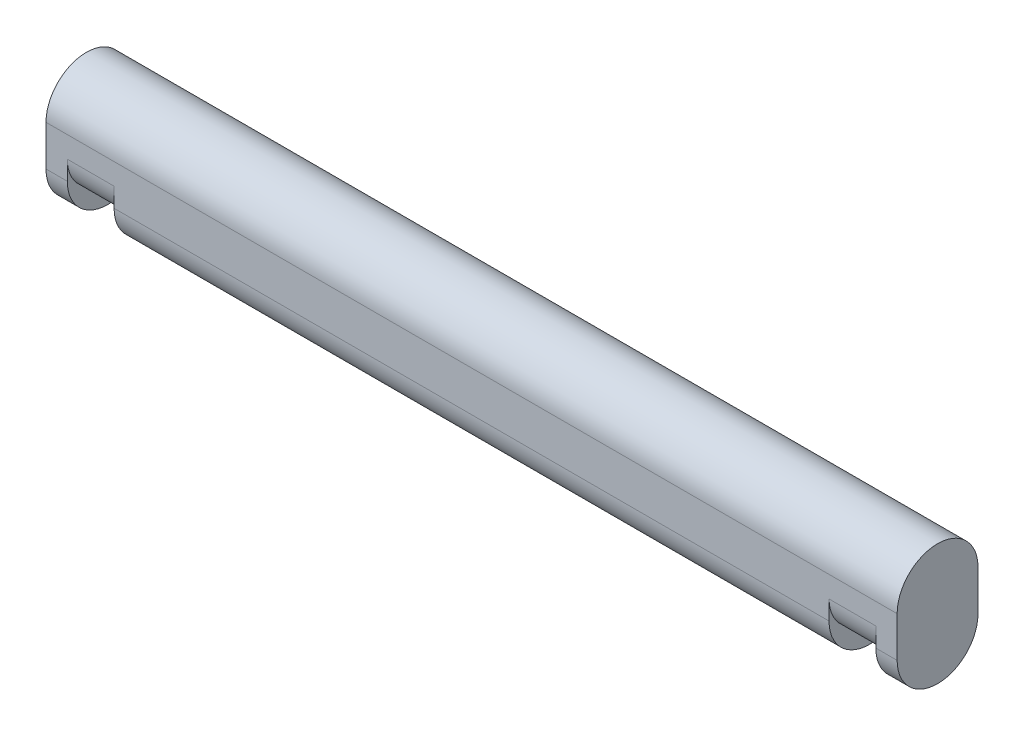
ISO-10303-21;
HEADER;
FILE_DESCRIPTION(('STEP AP214'),'2;1');
FILE_NAME('part.step','',(''),(''),'','','');
FILE_SCHEMA(('AUTOMOTIVE_DESIGN { 1 0 10303 214 1 1 1 1 }'));
ENDSEC;
DATA;
#1=APPLICATION_CONTEXT('core data for automotive mechanical design processes');
#2=APPLICATION_PROTOCOL_DEFINITION('international standard','automotive_design',2000,#1);
#3=PRODUCT_CONTEXT('',#1,'mechanical');
#4=PRODUCT('Part','Part','',(#3));
#5=PRODUCT_RELATED_PRODUCT_CATEGORY('part','',(#4));
#6=PRODUCT_DEFINITION_FORMATION('','',#4);
#7=PRODUCT_DEFINITION_CONTEXT('part definition',#1,'design');
#8=PRODUCT_DEFINITION('design','',#6,#7);
#9=PRODUCT_DEFINITION_SHAPE('','',#8);
#10=(LENGTH_UNIT() NAMED_UNIT(*) SI_UNIT(.MILLI.,.METRE.));
#11=(NAMED_UNIT(*) PLANE_ANGLE_UNIT() SI_UNIT($,.RADIAN.));
#12=(NAMED_UNIT(*) SI_UNIT($,.STERADIAN.) SOLID_ANGLE_UNIT());
#13=UNCERTAINTY_MEASURE_WITH_UNIT(LENGTH_MEASURE(1.E-05),#10,'distance_accuracy_value','');
#14=(GEOMETRIC_REPRESENTATION_CONTEXT(3) GLOBAL_UNCERTAINTY_ASSIGNED_CONTEXT((#13)) GLOBAL_UNIT_ASSIGNED_CONTEXT((#10,
#11,#12)) REPRESENTATION_CONTEXT('',''));
#15=CARTESIAN_POINT('',(0.,0.,0.));
#16=DIRECTION('',(0.,0.,1.));
#17=DIRECTION('',(1.,0.,0.));
#18=AXIS2_PLACEMENT_3D('',#15,#16,#17);
#19=CARTESIAN_POINT('',(200.,-9.5,0.));
#20=DIRECTION('',(-1.,0.,0.));
#21=DIRECTION('',(0.,0.,1.));
#22=AXIS2_PLACEMENT_3D('',#19,#20,#21);
#23=CYLINDRICAL_SURFACE('',#22,9.5);
#24=DIRECTION('',(-1.,0.,0.));
#25=VECTOR('',#24,1.);
#26=CARTESIAN_POINT('',(200.,-9.5,-9.5));
#27=LINE('',#26,#25);
#28=CARTESIAN_POINT('',(184.,-9.5,-9.5));
#29=VERTEX_POINT('',#28);
#30=CARTESIAN_POINT('',(16.,-9.5,-9.5));
#31=VERTEX_POINT('',#30);
#32=EDGE_CURVE('E269',#29,#31,#27,.T.);
#33=ORIENTED_EDGE('',*,*,#32,.F.);
#34=CARTESIAN_POINT('',(184.,-9.5,0.));
#35=DIRECTION('',(-1.,0.,0.));
#36=DIRECTION('',(0.,-1.,0.));
#37=AXIS2_PLACEMENT_3D('',#34,#35,#36);
#38=CIRCLE('',#37,9.5);
#39=CARTESIAN_POINT('',(184.,-9.5,9.5));
#40=VERTEX_POINT('',#39);
#41=EDGE_CURVE('E48',#29,#40,#38,.T.);
#42=ORIENTED_EDGE('',*,*,#41,.T.);
#43=DIRECTION('',(-1.,0.,0.));
#44=VECTOR('',#43,1.);
#45=CARTESIAN_POINT('',(200.,-9.5,9.5));
#46=LINE('',#45,#44);
#47=CARTESIAN_POINT('',(16.,-9.5,9.5));
#48=VERTEX_POINT('',#47);
#49=EDGE_CURVE('E177',#40,#48,#46,.T.);
#50=ORIENTED_EDGE('',*,*,#49,.T.);
#51=CARTESIAN_POINT('',(16.,-9.5,0.));
#52=DIRECTION('',(-1.,0.,0.));
#53=DIRECTION('',(0.,-1.,0.));
#54=AXIS2_PLACEMENT_3D('',#51,#52,#53);
#55=CIRCLE('',#54,9.5);
#56=EDGE_CURVE('E175',#31,#48,#55,.T.);
#57=ORIENTED_EDGE('',*,*,#56,.F.);
#58=EDGE_LOOP('',(#33,#42,#50,#57));
#59=FACE_BOUND('',#58,.T.);
#60=ADVANCED_FACE('F33',(#59),#23,.T.);
#61=CARTESIAN_POINT('',(195.,-9.5,0.));
#62=DIRECTION('',(-1.,0.,0.));
#63=DIRECTION('',(0.,-1.,0.));
#64=AXIS2_PLACEMENT_3D('',#61,#62,#63);
#65=CIRCLE('',#64,9.5);
#66=CARTESIAN_POINT('',(195.,-9.5,-9.5));
#67=VERTEX_POINT('',#66);
#68=CARTESIAN_POINT('',(195.,-9.5,9.5));
#69=VERTEX_POINT('',#68);
#70=EDGE_CURVE('E56',#67,#69,#65,.T.);
#71=ORIENTED_EDGE('',*,*,#70,.F.);
#72=CARTESIAN_POINT('',(200.,-9.5,-9.5));
#73=VERTEX_POINT('',#72);
#74=EDGE_CURVE('E264',#73,#67,#27,.T.);
#75=ORIENTED_EDGE('',*,*,#74,.F.);
#76=CARTESIAN_POINT('',(200.,-9.5,0.));
#77=DIRECTION('',(1.,0.,0.));
#78=DIRECTION('',(0.,0.,-1.));
#79=AXIS2_PLACEMENT_3D('',#76,#77,#78);
#80=CIRCLE('',#79,9.5);
#81=CARTESIAN_POINT('',(200.,-9.5,9.5));
#82=VERTEX_POINT('',#81);
#83=EDGE_CURVE('E158',#82,#73,#80,.T.);
#84=ORIENTED_EDGE('',*,*,#83,.F.);
#85=EDGE_CURVE('E155',#82,#69,#46,.T.);
#86=ORIENTED_EDGE('',*,*,#85,.T.);
#87=EDGE_LOOP('',(#71,#75,#84,#86));
#88=FACE_BOUND('',#87,.T.);
#89=ADVANCED_FACE('F319',(#88),#23,.T.);
#90=CARTESIAN_POINT('',(5.,-9.5,-9.5));
#91=VERTEX_POINT('',#90);
#92=CARTESIAN_POINT('',(0.,-9.5,-9.5));
#93=VERTEX_POINT('',#92);
#94=EDGE_CURVE('E270',#91,#93,#27,.T.);
#95=ORIENTED_EDGE('',*,*,#94,.F.);
#96=CARTESIAN_POINT('',(5.,-9.5,0.));
#97=DIRECTION('',(-1.,0.,0.));
#98=DIRECTION('',(0.,-1.,0.));
#99=AXIS2_PLACEMENT_3D('',#96,#97,#98);
#100=CIRCLE('',#99,9.5);
#101=CARTESIAN_POINT('',(5.,-9.5,9.5));
#102=VERTEX_POINT('',#101);
#103=EDGE_CURVE('E173',#91,#102,#100,.T.);
#104=ORIENTED_EDGE('',*,*,#103,.T.);
#105=CARTESIAN_POINT('',(0.,-9.5,9.5));
#106=VERTEX_POINT('',#105);
#107=EDGE_CURVE('E179',#102,#106,#46,.T.);
#108=ORIENTED_EDGE('',*,*,#107,.T.);
#109=CARTESIAN_POINT('',(0.,-9.5,0.));
#110=DIRECTION('',(1.,0.,0.));
#111=DIRECTION('',(0.,0.,-1.));
#112=AXIS2_PLACEMENT_3D('',#109,#110,#111);
#113=CIRCLE('',#112,9.5);
#114=EDGE_CURVE('E278',#106,#93,#113,.T.);
#115=ORIENTED_EDGE('',*,*,#114,.T.);
#116=EDGE_LOOP('',(#95,#104,#108,#115));
#117=FACE_BOUND('',#116,.T.);
#118=ADVANCED_FACE('F307',(#117),#23,.T.);
#119=CARTESIAN_POINT('',(200.,0.,0.));
#120=DIRECTION('',(-1.,0.,0.));
#121=DIRECTION('',(0.,0.,1.));
#122=AXIS2_PLACEMENT_3D('',#119,#120,#121);
#123=CYLINDRICAL_SURFACE('',#122,9.5);
#124=CARTESIAN_POINT('',(0.,0.,0.));
#125=DIRECTION('',(1.,0.,0.));
#126=DIRECTION('',(0.,0.,-1.));
#127=AXIS2_PLACEMENT_3D('',#124,#125,#126);
#128=CIRCLE('',#127,9.5);
#129=CARTESIAN_POINT('',(0.,0.,-9.5));
#130=VERTEX_POINT('',#129);
#131=CARTESIAN_POINT('',(0.,0.,9.5));
#132=VERTEX_POINT('',#131);
#133=EDGE_CURVE('E172',#130,#132,#128,.T.);
#134=ORIENTED_EDGE('',*,*,#133,.T.);
#135=DIRECTION('',(-1.,0.,0.));
#136=VECTOR('',#135,1.);
#137=CARTESIAN_POINT('',(200.,0.,9.5));
#138=LINE('',#137,#136);
#139=CARTESIAN_POINT('',(200.,0.,9.5));
#140=VERTEX_POINT('',#139);
#141=EDGE_CURVE('E152',#140,#132,#138,.T.);
#142=ORIENTED_EDGE('',*,*,#141,.F.);
#143=CARTESIAN_POINT('',(200.,0.,0.));
#144=DIRECTION('',(1.,0.,0.));
#145=DIRECTION('',(0.,0.,-1.));
#146=AXIS2_PLACEMENT_3D('',#143,#144,#145);
#147=CIRCLE('',#146,9.5);
#148=CARTESIAN_POINT('',(200.,0.,-9.5));
#149=VERTEX_POINT('',#148);
#150=EDGE_CURVE('E159',#149,#140,#147,.T.);
#151=ORIENTED_EDGE('',*,*,#150,.F.);
#152=DIRECTION('',(-1.,0.,0.));
#153=VECTOR('',#152,1.);
#154=CARTESIAN_POINT('',(200.,0.,-9.5));
#155=LINE('',#154,#153);
#156=EDGE_CURVE('E273',#149,#130,#155,.T.);
#157=ORIENTED_EDGE('',*,*,#156,.T.);
#158=EDGE_LOOP('',(#134,#142,#151,#157));
#159=FACE_BOUND('',#158,.T.);
#160=ADVANCED_FACE('F170',(#159),#123,.T.);
#161=CARTESIAN_POINT('',(200.,0.,9.5));
#162=DIRECTION('',(0.,0.,-1.));
#163=DIRECTION('',(0.,1.,0.));
#164=AXIS2_PLACEMENT_3D('',#161,#162,#163);
#165=PLANE('',#164);
#166=DIRECTION('',(1.,0.,0.));
#167=VECTOR('',#166,1.);
#168=CARTESIAN_POINT('',(200.,-5.,9.5));
#169=LINE('',#168,#167);
#170=CARTESIAN_POINT('',(184.,-5.,9.5));
#171=VERTEX_POINT('',#170);
#172=CARTESIAN_POINT('',(195.,-5.,9.5));
#173=VERTEX_POINT('',#172);
#174=EDGE_CURVE('E234',#171,#173,#169,.T.);
#175=ORIENTED_EDGE('',*,*,#174,.T.);
#176=DIRECTION('',(0.,-1.,0.));
#177=VECTOR('',#176,1.);
#178=CARTESIAN_POINT('',(195.,0.,9.5));
#179=LINE('',#178,#177);
#180=EDGE_CURVE('E236',#173,#69,#179,.T.);
#181=ORIENTED_EDGE('',*,*,#180,.T.);
#182=ORIENTED_EDGE('',*,*,#85,.F.);
#183=DIRECTION('',(0.,-1.,0.));
#184=VECTOR('',#183,1.);
#185=CARTESIAN_POINT('',(200.,0.,9.5));
#186=LINE('',#185,#184);
#187=EDGE_CURVE('E146',#140,#82,#186,.T.);
#188=ORIENTED_EDGE('',*,*,#187,.F.);
#189=ORIENTED_EDGE('',*,*,#141,.T.);
#190=DIRECTION('',(0.,-1.,0.));
#191=VECTOR('',#190,1.);
#192=CARTESIAN_POINT('',(0.,0.,9.5));
#193=LINE('',#192,#191);
#194=EDGE_CURVE('E280',#132,#106,#193,.T.);
#195=ORIENTED_EDGE('',*,*,#194,.T.);
#196=ORIENTED_EDGE('',*,*,#107,.F.);
#197=DIRECTION('',(0.,1.,0.));
#198=VECTOR('',#197,1.);
#199=CARTESIAN_POINT('',(5.,0.,9.5));
#200=LINE('',#199,#198);
#201=CARTESIAN_POINT('',(5.,-5.,9.5));
#202=VERTEX_POINT('',#201);
#203=EDGE_CURVE('E205',#102,#202,#200,.T.);
#204=ORIENTED_EDGE('',*,*,#203,.T.);
#205=DIRECTION('',(-1.,0.,0.));
#206=VECTOR('',#205,1.);
#207=CARTESIAN_POINT('',(0.,-5.,9.5));
#208=LINE('',#207,#206);
#209=CARTESIAN_POINT('',(16.,-5.,9.5));
#210=VERTEX_POINT('',#209);
#211=EDGE_CURVE('E202',#202,#210,#208,.F.);
#212=ORIENTED_EDGE('',*,*,#211,.T.);
#213=DIRECTION('',(0.,-1.,0.));
#214=VECTOR('',#213,1.);
#215=CARTESIAN_POINT('',(16.,0.,9.5));
#216=LINE('',#215,#214);
#217=EDGE_CURVE('E199',#210,#48,#216,.T.);
#218=ORIENTED_EDGE('',*,*,#217,.T.);
#219=ORIENTED_EDGE('',*,*,#49,.F.);
#220=DIRECTION('',(0.,1.,0.));
#221=VECTOR('',#220,1.);
#222=CARTESIAN_POINT('',(184.,0.,9.5));
#223=LINE('',#222,#221);
#224=EDGE_CURVE('E231',#40,#171,#223,.T.);
#225=ORIENTED_EDGE('',*,*,#224,.T.);
#226=EDGE_LOOP('',(#175,#181,#182,#188,#189,#195,#196,#204,#212,#218,#219,#225));
#227=FACE_BOUND('',#226,.T.);
#228=ADVANCED_FACE('F149',(#227),#165,.F.);
#229=CARTESIAN_POINT('',(200.,-9.5,-9.5));
#230=DIRECTION('',(0.,0.,1.));
#231=DIRECTION('',(0.,-1.,0.));
#232=AXIS2_PLACEMENT_3D('',#229,#230,#231);
#233=PLANE('',#232);
#234=DIRECTION('',(-1.,0.,0.));
#235=VECTOR('',#234,1.);
#236=CARTESIAN_POINT('',(200.,-5.,-9.5));
#237=LINE('',#236,#235);
#238=CARTESIAN_POINT('',(195.,-5.,-9.5));
#239=VERTEX_POINT('',#238);
#240=CARTESIAN_POINT('',(184.,-5.,-9.5));
#241=VERTEX_POINT('',#240);
#242=EDGE_CURVE('E221',#239,#241,#237,.T.);
#243=ORIENTED_EDGE('',*,*,#242,.T.);
#244=DIRECTION('',(0.,-1.,0.));
#245=VECTOR('',#244,1.);
#246=CARTESIAN_POINT('',(184.,-9.49999999999999,-9.5));
#247=LINE('',#246,#245);
#248=EDGE_CURVE('E224',#241,#29,#247,.T.);
#249=ORIENTED_EDGE('',*,*,#248,.T.);
#250=ORIENTED_EDGE('',*,*,#32,.T.);
#251=DIRECTION('',(0.,1.,0.));
#252=VECTOR('',#251,1.);
#253=CARTESIAN_POINT('',(16.,0.,-9.5));
#254=LINE('',#253,#252);
#255=CARTESIAN_POINT('',(16.,-5.,-9.5));
#256=VERTEX_POINT('',#255);
#257=EDGE_CURVE('E196',#31,#256,#254,.T.);
#258=ORIENTED_EDGE('',*,*,#257,.T.);
#259=DIRECTION('',(1.,0.,0.));
#260=VECTOR('',#259,1.);
#261=CARTESIAN_POINT('',(0.,-5.,-9.5));
#262=LINE('',#261,#260);
#263=CARTESIAN_POINT('',(5.,-5.,-9.5));
#264=VERTEX_POINT('',#263);
#265=EDGE_CURVE('E193',#256,#264,#262,.F.);
#266=ORIENTED_EDGE('',*,*,#265,.T.);
#267=DIRECTION('',(0.,-1.,0.));
#268=VECTOR('',#267,1.);
#269=CARTESIAN_POINT('',(5.,-9.50000000000004,-9.5));
#270=LINE('',#269,#268);
#271=EDGE_CURVE('E190',#264,#91,#270,.T.);
#272=ORIENTED_EDGE('',*,*,#271,.T.);
#273=ORIENTED_EDGE('',*,*,#94,.T.);
#274=DIRECTION('',(0.,1.,0.));
#275=VECTOR('',#274,1.);
#276=CARTESIAN_POINT('',(0.,-9.5,-9.5));
#277=LINE('',#276,#275);
#278=EDGE_CURVE('E168',#93,#130,#277,.T.);
#279=ORIENTED_EDGE('',*,*,#278,.T.);
#280=ORIENTED_EDGE('',*,*,#156,.F.);
#281=DIRECTION('',(0.,1.,0.));
#282=VECTOR('',#281,1.);
#283=CARTESIAN_POINT('',(200.,-9.5,-9.5));
#284=LINE('',#283,#282);
#285=EDGE_CURVE('E164',#73,#149,#284,.T.);
#286=ORIENTED_EDGE('',*,*,#285,.F.);
#287=ORIENTED_EDGE('',*,*,#74,.T.);
#288=DIRECTION('',(0.,1.,0.));
#289=VECTOR('',#288,1.);
#290=CARTESIAN_POINT('',(195.,0.,-9.5));
#291=LINE('',#290,#289);
#292=EDGE_CURVE('E218',#67,#239,#291,.T.);
#293=ORIENTED_EDGE('',*,*,#292,.T.);
#294=EDGE_LOOP('',(#243,#249,#250,#258,#266,#272,#273,#279,#280,#286,#287,#293));
#295=FACE_BOUND('',#294,.T.);
#296=ADVANCED_FACE('F308',(#295),#233,.F.);
#297=CARTESIAN_POINT('',(200.,0.,0.));
#298=DIRECTION('',(1.,0.,0.));
#299=DIRECTION('',(0.,0.,-1.));
#300=AXIS2_PLACEMENT_3D('',#297,#298,#299);
#301=PLANE('',#300);
#302=ORIENTED_EDGE('',*,*,#150,.T.);
#303=ORIENTED_EDGE('',*,*,#187,.T.);
#304=ORIENTED_EDGE('',*,*,#83,.T.);
#305=ORIENTED_EDGE('',*,*,#285,.T.);
#306=EDGE_LOOP('',(#302,#303,#304,#305));
#307=FACE_BOUND('',#306,.T.);
#308=ADVANCED_FACE('F162',(#307),#301,.T.);
#309=CARTESIAN_POINT('',(0.,0.,0.));
#310=DIRECTION('',(1.,0.,0.));
#311=DIRECTION('',(0.,0.,-1.));
#312=AXIS2_PLACEMENT_3D('',#309,#310,#311);
#313=PLANE('',#312);
#314=ORIENTED_EDGE('',*,*,#133,.F.);
#315=ORIENTED_EDGE('',*,*,#278,.F.);
#316=ORIENTED_EDGE('',*,*,#114,.F.);
#317=ORIENTED_EDGE('',*,*,#194,.F.);
#318=EDGE_LOOP('',(#314,#315,#316,#317));
#319=FACE_BOUND('',#318,.T.);
#320=ADVANCED_FACE('F306',(#319),#313,.F.);
#321=CARTESIAN_POINT('',(0.,-14.,-10.));
#322=DIRECTION('',(0.,-1.,0.));
#323=DIRECTION('',(0.,0.,-1.));
#324=AXIS2_PLACEMENT_3D('',#321,#322,#323);
#325=PLANE('',#324);
#326=DIRECTION('',(0.,0.,1.));
#327=VECTOR('',#326,1.);
#328=CARTESIAN_POINT('',(5.,-14.,-10.));
#329=LINE('',#328,#327);
#330=CARTESIAN_POINT('',(5.,-14.,-0.499999999999999));
#331=VERTEX_POINT('',#330);
#332=CARTESIAN_POINT('',(5.,-14.,0.499999999999999));
#333=VERTEX_POINT('',#332);
#334=EDGE_CURVE('E256',#331,#333,#329,.T.);
#335=ORIENTED_EDGE('',*,*,#334,.F.);
#336=DIRECTION('',(1.,0.,0.));
#337=VECTOR('',#336,1.);
#338=CARTESIAN_POINT('',(0.,-14.,-0.499999999999999));
#339=LINE('',#338,#337);
#340=CARTESIAN_POINT('',(16.,-14.,-0.499999999999999));
#341=VERTEX_POINT('',#340);
#342=EDGE_CURVE('E187',#331,#341,#339,.T.);
#343=ORIENTED_EDGE('',*,*,#342,.T.);
#344=DIRECTION('',(0.,0.,1.));
#345=VECTOR('',#344,1.);
#346=CARTESIAN_POINT('',(16.,-14.,-10.));
#347=LINE('',#346,#345);
#348=CARTESIAN_POINT('',(16.,-14.,0.499999999999999));
#349=VERTEX_POINT('',#348);
#350=EDGE_CURVE('E282',#341,#349,#347,.T.);
#351=ORIENTED_EDGE('',*,*,#350,.T.);
#352=DIRECTION('',(-1.,0.,0.));
#353=VECTOR('',#352,1.);
#354=CARTESIAN_POINT('',(0.,-14.,0.499999999999999));
#355=LINE('',#354,#353);
#356=EDGE_CURVE('E184',#349,#333,#355,.T.);
#357=ORIENTED_EDGE('',*,*,#356,.T.);
#358=EDGE_LOOP('',(#335,#343,#351,#357));
#359=FACE_BOUND('',#358,.T.);
#360=ADVANCED_FACE('F293',(#359),#325,.T.);
#361=CARTESIAN_POINT('',(16.,0.,-10.));
#362=DIRECTION('',(-1.,0.,0.));
#363=DIRECTION('',(0.,-1.,0.));
#364=AXIS2_PLACEMENT_3D('',#361,#362,#363);
#365=PLANE('',#364);
#366=ORIENTED_EDGE('',*,*,#56,.T.);
#367=ORIENTED_EDGE('',*,*,#217,.F.);
#368=CARTESIAN_POINT('',(16.,-5.,0.499999999999999));
#369=DIRECTION('',(-1.,0.,0.));
#370=DIRECTION('',(0.,-1.,0.));
#371=AXIS2_PLACEMENT_3D('',#368,#369,#370);
#372=CIRCLE('',#371,9.);
#373=EDGE_CURVE('E214',#210,#349,#372,.F.);
#374=ORIENTED_EDGE('',*,*,#373,.T.);
#375=ORIENTED_EDGE('',*,*,#350,.F.);
#376=CARTESIAN_POINT('',(16.,-5.,-0.499999999999999));
#377=DIRECTION('',(-1.,0.,0.));
#378=DIRECTION('',(0.,-1.,0.));
#379=AXIS2_PLACEMENT_3D('',#376,#377,#378);
#380=CIRCLE('',#379,9.);
#381=EDGE_CURVE('E208',#341,#256,#380,.F.);
#382=ORIENTED_EDGE('',*,*,#381,.T.);
#383=ORIENTED_EDGE('',*,*,#257,.F.);
#384=EDGE_LOOP('',(#366,#367,#374,#375,#382,#383));
#385=FACE_BOUND('',#384,.T.);
#386=ADVANCED_FACE('F314',(#385),#365,.T.);
#387=CARTESIAN_POINT('',(5.,0.,-10.));
#388=DIRECTION('',(-1.,0.,0.));
#389=DIRECTION('',(0.,-1.,0.));
#390=AXIS2_PLACEMENT_3D('',#387,#388,#389);
#391=PLANE('',#390);
#392=ORIENTED_EDGE('',*,*,#103,.F.);
#393=ORIENTED_EDGE('',*,*,#271,.F.);
#394=CARTESIAN_POINT('',(5.,-5.,-0.499999999999999));
#395=DIRECTION('',(-1.,0.,0.));
#396=DIRECTION('',(0.,-1.,0.));
#397=AXIS2_PLACEMENT_3D('',#394,#395,#396);
#398=CIRCLE('',#397,9.);
#399=EDGE_CURVE('E210',#264,#331,#398,.T.);
#400=ORIENTED_EDGE('',*,*,#399,.T.);
#401=ORIENTED_EDGE('',*,*,#334,.T.);
#402=CARTESIAN_POINT('',(5.,-5.,0.499999999999999));
#403=DIRECTION('',(-1.,0.,0.));
#404=DIRECTION('',(0.,-1.,0.));
#405=AXIS2_PLACEMENT_3D('',#402,#403,#404);
#406=CIRCLE('',#405,9.);
#407=EDGE_CURVE('E212',#333,#202,#406,.T.);
#408=ORIENTED_EDGE('',*,*,#407,.T.);
#409=ORIENTED_EDGE('',*,*,#203,.F.);
#410=EDGE_LOOP('',(#392,#393,#400,#401,#408,#409));
#411=FACE_BOUND('',#410,.T.);
#412=ADVANCED_FACE('F302',(#411),#391,.F.);
#413=CARTESIAN_POINT('',(0.,-5.,-0.499999999999999));
#414=DIRECTION('',(-1.,0.,0.));
#415=DIRECTION('',(0.,0.,1.));
#416=AXIS2_PLACEMENT_3D('',#413,#414,#415);
#417=CYLINDRICAL_SURFACE('',#416,9.);
#418=ORIENTED_EDGE('',*,*,#399,.F.);
#419=ORIENTED_EDGE('',*,*,#265,.F.);
#420=ORIENTED_EDGE('',*,*,#381,.F.);
#421=ORIENTED_EDGE('',*,*,#342,.F.);
#422=EDGE_LOOP('',(#418,#419,#420,#421));
#423=FACE_BOUND('',#422,.T.);
#424=ADVANCED_FACE('F313',(#423),#417,.T.);
#425=CARTESIAN_POINT('',(0.,-5.,0.499999999999999));
#426=DIRECTION('',(1.,0.,0.));
#427=DIRECTION('',(0.,0.,-1.));
#428=AXIS2_PLACEMENT_3D('',#425,#426,#427);
#429=CYLINDRICAL_SURFACE('',#428,9.);
#430=ORIENTED_EDGE('',*,*,#373,.F.);
#431=ORIENTED_EDGE('',*,*,#211,.F.);
#432=ORIENTED_EDGE('',*,*,#407,.F.);
#433=ORIENTED_EDGE('',*,*,#356,.F.);
#434=EDGE_LOOP('',(#430,#431,#432,#433));
#435=FACE_BOUND('',#434,.T.);
#436=ADVANCED_FACE('F298',(#435),#429,.T.);
#437=CARTESIAN_POINT('',(200.,-14.,-10.));
#438=DIRECTION('',(0.,1.,0.));
#439=DIRECTION('',(0.,0.,1.));
#440=AXIS2_PLACEMENT_3D('',#437,#438,#439);
#441=PLANE('',#440);
#442=DIRECTION('',(0.,0.,1.));
#443=VECTOR('',#442,1.);
#444=CARTESIAN_POINT('',(184.,-14.,-10.));
#445=LINE('',#444,#443);
#446=CARTESIAN_POINT('',(184.,-14.,-0.499999999999999));
#447=VERTEX_POINT('',#446);
#448=CARTESIAN_POINT('',(184.,-14.,0.499999999999999));
#449=VERTEX_POINT('',#448);
#450=EDGE_CURVE('E257',#447,#449,#445,.T.);
#451=ORIENTED_EDGE('',*,*,#450,.F.);
#452=DIRECTION('',(-1.,0.,0.));
#453=VECTOR('',#452,1.);
#454=CARTESIAN_POINT('',(200.,-14.,-0.499999999999999));
#455=LINE('',#454,#453);
#456=CARTESIAN_POINT('',(195.,-14.,-0.499999999999999));
#457=VERTEX_POINT('',#456);
#458=EDGE_CURVE('E229',#447,#457,#455,.F.);
#459=ORIENTED_EDGE('',*,*,#458,.T.);
#460=DIRECTION('',(0.,0.,1.));
#461=VECTOR('',#460,1.);
#462=CARTESIAN_POINT('',(195.,-14.,-10.));
#463=LINE('',#462,#461);
#464=CARTESIAN_POINT('',(195.,-14.,0.499999999999999));
#465=VERTEX_POINT('',#464);
#466=EDGE_CURVE('E246',#457,#465,#463,.T.);
#467=ORIENTED_EDGE('',*,*,#466,.T.);
#468=DIRECTION('',(1.,0.,0.));
#469=VECTOR('',#468,1.);
#470=CARTESIAN_POINT('',(200.,-14.,0.499999999999999));
#471=LINE('',#470,#469);
#472=EDGE_CURVE('E227',#465,#449,#471,.F.);
#473=ORIENTED_EDGE('',*,*,#472,.T.);
#474=EDGE_LOOP('',(#451,#459,#467,#473));
#475=FACE_BOUND('',#474,.T.);
#476=ADVANCED_FACE('F253',(#475),#441,.F.);
#477=CARTESIAN_POINT('',(195.,0.,-10.));
#478=DIRECTION('',(-1.,0.,0.));
#479=DIRECTION('',(0.,-1.,0.));
#480=AXIS2_PLACEMENT_3D('',#477,#478,#479);
#481=PLANE('',#480);
#482=ORIENTED_EDGE('',*,*,#70,.T.);
#483=ORIENTED_EDGE('',*,*,#180,.F.);
#484=CARTESIAN_POINT('',(195.,-5.,0.5));
#485=DIRECTION('',(-1.,0.,0.));
#486=DIRECTION('',(0.,-1.,0.));
#487=AXIS2_PLACEMENT_3D('',#484,#485,#486);
#488=CIRCLE('',#487,9.);
#489=EDGE_CURVE('E41',#173,#465,#488,.F.);
#490=ORIENTED_EDGE('',*,*,#489,.T.);
#491=ORIENTED_EDGE('',*,*,#466,.F.);
#492=CARTESIAN_POINT('',(195.,-5.,-0.5));
#493=DIRECTION('',(-1.,0.,0.));
#494=DIRECTION('',(0.,-1.,0.));
#495=AXIS2_PLACEMENT_3D('',#492,#493,#494);
#496=CIRCLE('',#495,9.);
#497=EDGE_CURVE('E240',#457,#239,#496,.F.);
#498=ORIENTED_EDGE('',*,*,#497,.T.);
#499=ORIENTED_EDGE('',*,*,#292,.F.);
#500=EDGE_LOOP('',(#482,#483,#490,#491,#498,#499));
#501=FACE_BOUND('',#500,.T.);
#502=ADVANCED_FACE('F245',(#501),#481,.T.);
#503=CARTESIAN_POINT('',(184.,0.,-10.));
#504=DIRECTION('',(-1.,0.,0.));
#505=DIRECTION('',(0.,-1.,0.));
#506=AXIS2_PLACEMENT_3D('',#503,#504,#505);
#507=PLANE('',#506);
#508=ORIENTED_EDGE('',*,*,#41,.F.);
#509=ORIENTED_EDGE('',*,*,#248,.F.);
#510=CARTESIAN_POINT('',(184.,-5.,-0.5));
#511=DIRECTION('',(-1.,0.,0.));
#512=DIRECTION('',(0.,-1.,0.));
#513=AXIS2_PLACEMENT_3D('',#510,#511,#512);
#514=CIRCLE('',#513,9.);
#515=EDGE_CURVE('E238',#241,#447,#514,.T.);
#516=ORIENTED_EDGE('',*,*,#515,.T.);
#517=ORIENTED_EDGE('',*,*,#450,.T.);
#518=CARTESIAN_POINT('',(184.,-5.,0.5));
#519=DIRECTION('',(-1.,0.,0.));
#520=DIRECTION('',(0.,-1.,0.));
#521=AXIS2_PLACEMENT_3D('',#518,#519,#520);
#522=CIRCLE('',#521,9.);
#523=EDGE_CURVE('E11',#449,#171,#522,.T.);
#524=ORIENTED_EDGE('',*,*,#523,.T.);
#525=ORIENTED_EDGE('',*,*,#224,.F.);
#526=EDGE_LOOP('',(#508,#509,#516,#517,#524,#525));
#527=FACE_BOUND('',#526,.T.);
#528=ADVANCED_FACE('F261',(#527),#507,.F.);
#529=CARTESIAN_POINT('',(200.,-5.,-0.5));
#530=DIRECTION('',(-1.,0.,0.));
#531=DIRECTION('',(0.,0.,1.));
#532=AXIS2_PLACEMENT_3D('',#529,#530,#531);
#533=CYLINDRICAL_SURFACE('',#532,9.);
#534=ORIENTED_EDGE('',*,*,#497,.F.);
#535=ORIENTED_EDGE('',*,*,#458,.F.);
#536=ORIENTED_EDGE('',*,*,#515,.F.);
#537=ORIENTED_EDGE('',*,*,#242,.F.);
#538=EDGE_LOOP('',(#534,#535,#536,#537));
#539=FACE_BOUND('',#538,.T.);
#540=ADVANCED_FACE('F318',(#539),#533,.T.);
#541=CARTESIAN_POINT('',(200.,-5.,0.5));
#542=DIRECTION('',(1.,0.,0.));
#543=DIRECTION('',(0.,0.,-1.));
#544=AXIS2_PLACEMENT_3D('',#541,#542,#543);
#545=CYLINDRICAL_SURFACE('',#544,9.);
#546=ORIENTED_EDGE('',*,*,#523,.F.);
#547=ORIENTED_EDGE('',*,*,#472,.F.);
#548=ORIENTED_EDGE('',*,*,#489,.F.);
#549=ORIENTED_EDGE('',*,*,#174,.F.);
#550=EDGE_LOOP('',(#546,#547,#548,#549));
#551=FACE_BOUND('',#550,.T.);
#552=ADVANCED_FACE('F35',(#551),#545,.T.);
#553=CLOSED_SHELL('',(#60,#89,#118,#160,#228,#296,#308,#320,#360,#386,#412,#424,#436,#476,#502,
#528,#540,#552));
#554=MANIFOLD_SOLID_BREP('B2',#553);
#555=ADVANCED_BREP_SHAPE_REPRESENTATION('',(#18,#554),#14);
#556=SHAPE_DEFINITION_REPRESENTATION(#9,#555);
ENDSEC;
END-ISO-10303-21;
